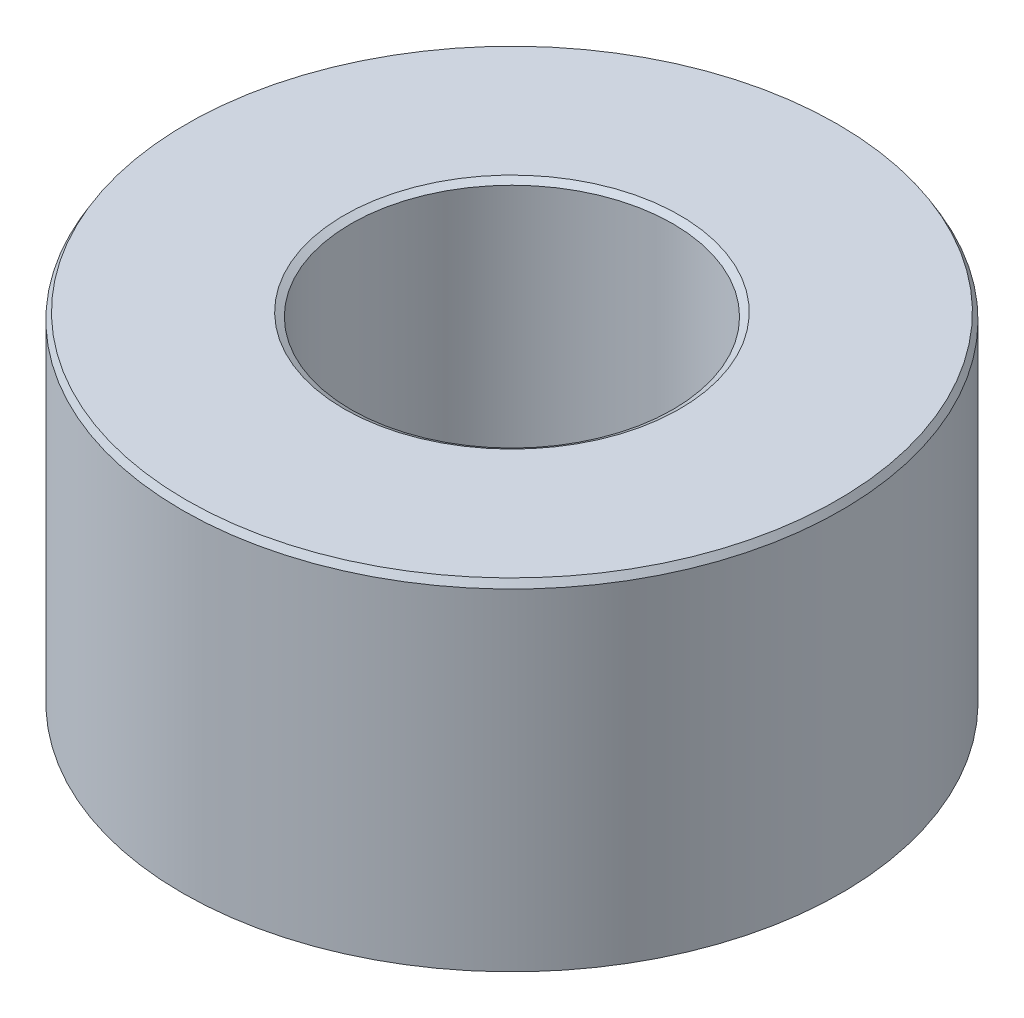
ISO-10303-21;
HEADER;
FILE_DESCRIPTION(('STEP AP214'),'2;1');
FILE_NAME('part.step','',(''),(''),'','','');
FILE_SCHEMA(('AUTOMOTIVE_DESIGN { 1 0 10303 214 1 1 1 1 }'));
ENDSEC;
DATA;
#1=APPLICATION_CONTEXT('core data for automotive mechanical design processes');
#2=APPLICATION_PROTOCOL_DEFINITION('international standard','automotive_design',2000,#1);
#3=PRODUCT_CONTEXT('',#1,'mechanical');
#4=PRODUCT('Part','Part','',(#3));
#5=PRODUCT_RELATED_PRODUCT_CATEGORY('part','',(#4));
#6=PRODUCT_DEFINITION_FORMATION('','',#4);
#7=PRODUCT_DEFINITION_CONTEXT('part definition',#1,'design');
#8=PRODUCT_DEFINITION('design','',#6,#7);
#9=PRODUCT_DEFINITION_SHAPE('','',#8);
#10=(LENGTH_UNIT() NAMED_UNIT(*) SI_UNIT(.MILLI.,.METRE.));
#11=(NAMED_UNIT(*) PLANE_ANGLE_UNIT() SI_UNIT($,.RADIAN.));
#12=(NAMED_UNIT(*) SI_UNIT($,.STERADIAN.) SOLID_ANGLE_UNIT());
#13=UNCERTAINTY_MEASURE_WITH_UNIT(LENGTH_MEASURE(1.E-05),#10,'distance_accuracy_value','');
#14=(GEOMETRIC_REPRESENTATION_CONTEXT(3) GLOBAL_UNCERTAINTY_ASSIGNED_CONTEXT((#13)) GLOBAL_UNIT_ASSIGNED_CONTEXT((#10,
#11,#12)) REPRESENTATION_CONTEXT('',''));
#15=CARTESIAN_POINT('',(0.,0.,0.));
#16=DIRECTION('',(0.,0.,1.));
#17=DIRECTION('',(1.,0.,0.));
#18=AXIS2_PLACEMENT_3D('',#15,#16,#17);
#19=CARTESIAN_POINT('',(0.,46.7350275397342,0.));
#20=DIRECTION('',(0.,-1.,0.));
#21=DIRECTION('',(0.,0.,-1.));
#22=AXIS2_PLACEMENT_3D('',#19,#20,#21);
#23=CYLINDRICAL_SURFACE('',#22,45.);
#24=CARTESIAN_POINT('',(0.,0.539629088290791,0.));
#25=DIRECTION('',(0.,1.,0.));
#26=DIRECTION('',(0.,0.,1.));
#27=AXIS2_PLACEMENT_3D('',#24,#25,#26);
#28=CIRCLE('',#27,45.);
#29=CARTESIAN_POINT('',(0.,0.539629088290791,45.));
#30=VERTEX_POINT('',#29);
#31=EDGE_CURVE('E10',#30,#30,#28,.T.);
#32=ORIENTED_EDGE('',*,*,#31,.T.);
#33=EDGE_LOOP('',(#32));
#34=FACE_BOUND('',#33,.T.);
#35=CARTESIAN_POINT('',(0.,45.8003625415725,0.));
#36=DIRECTION('',(0.,1.,0.));
#37=DIRECTION('',(0.,0.,1.));
#38=AXIS2_PLACEMENT_3D('',#35,#36,#37);
#39=CIRCLE('',#38,45.);
#40=CARTESIAN_POINT('',(0.,45.8003625415725,45.));
#41=VERTEX_POINT('',#40);
#42=EDGE_CURVE('E50',#41,#41,#39,.F.);
#43=ORIENTED_EDGE('',*,*,#42,.T.);
#44=EDGE_LOOP('',(#43));
#45=FACE_BOUND('',#44,.T.);
#46=ADVANCED_FACE('F39',(#34,#45),#23,.T.);
#47=CARTESIAN_POINT('',(0.,46.7350275397342,0.));
#48=DIRECTION('',(0.,1.,0.));
#49=DIRECTION('',(0.,0.,1.));
#50=AXIS2_PLACEMENT_3D('',#47,#48,#49);
#51=PLANE('',#50);
#52=CARTESIAN_POINT('',(0.,46.7350275397342,0.));
#53=DIRECTION('',(0.,1.,0.));
#54=DIRECTION('',(0.,0.,1.));
#55=AXIS2_PLACEMENT_3D('',#52,#53,#54);
#56=CIRCLE('',#55,22.9133526255897);
#57=CARTESIAN_POINT('',(0.,46.7350275397342,22.9133526255897));
#58=VERTEX_POINT('',#57);
#59=EDGE_CURVE('E58',#58,#58,#56,.F.);
#60=ORIENTED_EDGE('',*,*,#59,.T.);
#61=EDGE_LOOP('',(#60));
#62=FACE_BOUND('',#61,.T.);
#63=CARTESIAN_POINT('',(0.,46.7350275397342,0.));
#64=DIRECTION('',(0.,1.,0.));
#65=DIRECTION('',(0.,0.,1.));
#66=AXIS2_PLACEMENT_3D('',#63,#64,#65);
#67=CIRCLE('',#66,44.4603709117092);
#68=CARTESIAN_POINT('',(0.,46.7350275397342,44.4603709117092));
#69=VERTEX_POINT('',#68);
#70=EDGE_CURVE('E61',#69,#69,#67,.T.);
#71=ORIENTED_EDGE('',*,*,#70,.T.);
#72=EDGE_LOOP('',(#71));
#73=FACE_BOUND('',#72,.T.);
#74=ADVANCED_FACE('F88',(#62,#73),#51,.T.);
#75=CARTESIAN_POINT('',(0.,0.,0.));
#76=DIRECTION('',(0.,1.,0.));
#77=DIRECTION('',(0.,0.,1.));
#78=AXIS2_PLACEMENT_3D('',#75,#76,#77);
#79=PLANE('',#78);
#80=CARTESIAN_POINT('',(0.,0.,0.));
#81=DIRECTION('',(0.,1.,0.));
#82=DIRECTION('',(0.,0.,1.));
#83=AXIS2_PLACEMENT_3D('',#80,#81,#82);
#84=CIRCLE('',#83,22.5183167157188);
#85=CARTESIAN_POINT('',(0.,0.,22.5183167157188));
#86=VERTEX_POINT('',#85);
#87=EDGE_CURVE('E51',#86,#86,#84,.T.);
#88=ORIENTED_EDGE('',*,*,#87,.T.);
#89=EDGE_LOOP('',(#88));
#90=FACE_BOUND('',#89,.T.);
#91=CARTESIAN_POINT('',(0.,0.,0.));
#92=DIRECTION('',(0.,1.,0.));
#93=DIRECTION('',(0.,0.,1.));
#94=AXIS2_PLACEMENT_3D('',#91,#92,#93);
#95=CIRCLE('',#94,44.0653350018383);
#96=CARTESIAN_POINT('',(0.,0.,44.0653350018383));
#97=VERTEX_POINT('',#96);
#98=EDGE_CURVE('E54',#97,#97,#95,.F.);
#99=ORIENTED_EDGE('',*,*,#98,.T.);
#100=EDGE_LOOP('',(#99));
#101=FACE_BOUND('',#100,.T.);
#102=ADVANCED_FACE('F83',(#90,#101),#79,.F.);
#103=CARTESIAN_POINT('',(0.,46.7350275397342,0.));
#104=DIRECTION('',(0.,-1.,0.));
#105=DIRECTION('',(0.,0.,-1.));
#106=AXIS2_PLACEMENT_3D('',#103,#104,#105);
#107=CYLINDRICAL_SURFACE('',#106,21.978687627428);
#108=CARTESIAN_POINT('',(0.,46.1953984514434,0.));
#109=DIRECTION('',(0.,1.,0.));
#110=DIRECTION('',(0.,0.,1.));
#111=AXIS2_PLACEMENT_3D('',#108,#109,#110);
#112=CIRCLE('',#111,21.978687627428);
#113=CARTESIAN_POINT('',(0.,46.1953984514434,21.978687627428));
#114=VERTEX_POINT('',#113);
#115=EDGE_CURVE('E67',#114,#114,#112,.T.);
#116=ORIENTED_EDGE('',*,*,#115,.T.);
#117=EDGE_LOOP('',(#116));
#118=FACE_BOUND('',#117,.T.);
#119=CARTESIAN_POINT('',(0.,0.934664998161715,0.));
#120=DIRECTION('',(0.,1.,0.));
#121=DIRECTION('',(0.,0.,1.));
#122=AXIS2_PLACEMENT_3D('',#119,#120,#121);
#123=CIRCLE('',#122,21.978687627428);
#124=CARTESIAN_POINT('',(0.,0.934664998161715,21.978687627428));
#125=VERTEX_POINT('',#124);
#126=EDGE_CURVE('E69',#125,#125,#123,.F.);
#127=ORIENTED_EDGE('',*,*,#126,.T.);
#128=EDGE_LOOP('',(#127));
#129=FACE_BOUND('',#128,.T.);
#130=ADVANCED_FACE('F71',(#118,#129),#107,.F.);
#131=CARTESIAN_POINT('',(0.,46.1953984514434,0.));
#132=DIRECTION('',(0.,1.,0.));
#133=DIRECTION('',(0.,0.,1.));
#134=AXIS2_PLACEMENT_3D('',#131,#132,#133);
#135=CONICAL_SURFACE('',#134,21.978687627428,1.0471975511966);
#136=ORIENTED_EDGE('',*,*,#59,.F.);
#137=EDGE_LOOP('',(#136));
#138=FACE_BOUND('',#137,.T.);
#139=ORIENTED_EDGE('',*,*,#115,.F.);
#140=EDGE_LOOP('',(#139));
#141=FACE_BOUND('',#140,.T.);
#142=ADVANCED_FACE('F77',(#138,#141),#135,.F.);
#143=CARTESIAN_POINT('',(0.,0.,0.));
#144=DIRECTION('',(0.,-1.,0.));
#145=DIRECTION('',(0.,0.,-1.));
#146=AXIS2_PLACEMENT_3D('',#143,#144,#145);
#147=CONICAL_SURFACE('',#146,22.5183167157188,0.523598775598299);
#148=ORIENTED_EDGE('',*,*,#126,.F.);
#149=EDGE_LOOP('',(#148));
#150=FACE_BOUND('',#149,.T.);
#151=ORIENTED_EDGE('',*,*,#87,.F.);
#152=EDGE_LOOP('',(#151));
#153=FACE_BOUND('',#152,.T.);
#154=ADVANCED_FACE('F73',(#150,#153),#147,.F.);
#155=CARTESIAN_POINT('',(0.,0.539629088290791,0.));
#156=DIRECTION('',(0.,1.,0.));
#157=DIRECTION('',(0.,0.,1.));
#158=AXIS2_PLACEMENT_3D('',#155,#156,#157);
#159=CONICAL_SURFACE('',#158,45.,1.04719755119661);
#160=ORIENTED_EDGE('',*,*,#98,.F.);
#161=EDGE_LOOP('',(#160));
#162=FACE_BOUND('',#161,.T.);
#163=ORIENTED_EDGE('',*,*,#31,.F.);
#164=EDGE_LOOP('',(#163));
#165=FACE_BOUND('',#164,.T.);
#166=ADVANCED_FACE('F76',(#162,#165),#159,.T.);
#167=CARTESIAN_POINT('',(0.,46.7350275397342,0.));
#168=DIRECTION('',(0.,-1.,0.));
#169=DIRECTION('',(0.,0.,-1.));
#170=AXIS2_PLACEMENT_3D('',#167,#168,#169);
#171=CONICAL_SURFACE('',#170,44.4603709117092,0.523598775598311);
#172=ORIENTED_EDGE('',*,*,#42,.F.);
#173=EDGE_LOOP('',(#172));
#174=FACE_BOUND('',#173,.T.);
#175=ORIENTED_EDGE('',*,*,#70,.F.);
#176=EDGE_LOOP('',(#175));
#177=FACE_BOUND('',#176,.T.);
#178=ADVANCED_FACE('F45',(#174,#177),#171,.T.);
#179=CLOSED_SHELL('',(#46,#74,#102,#130,#142,#154,#166,#178));
#180=MANIFOLD_SOLID_BREP('B2',#179);
#181=ADVANCED_BREP_SHAPE_REPRESENTATION('',(#18,#180),#14);
#182=SHAPE_DEFINITION_REPRESENTATION(#9,#181);
ENDSEC;
END-ISO-10303-21;
